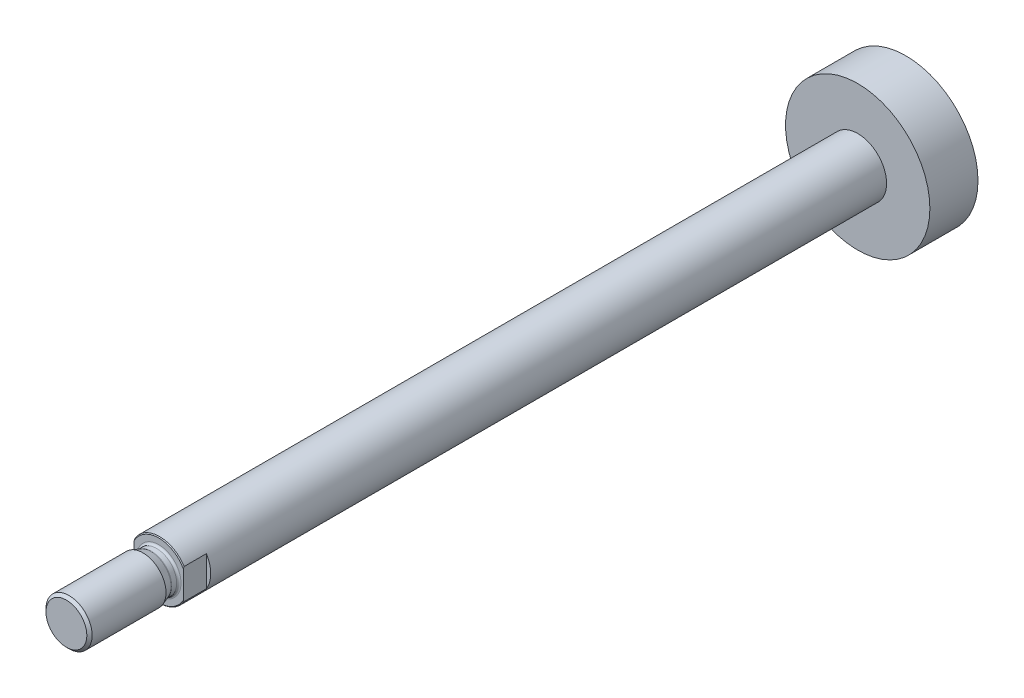
ISO-10303-21;
HEADER;
FILE_DESCRIPTION(('STEP AP214'),'2;1');
FILE_NAME('part.step','',(''),(''),'','','');
FILE_SCHEMA(('AUTOMOTIVE_DESIGN { 1 0 10303 214 1 1 1 1 }'));
ENDSEC;
DATA;
#1=APPLICATION_CONTEXT('core data for automotive mechanical design processes');
#2=APPLICATION_PROTOCOL_DEFINITION('international standard','automotive_design',2000,#1);
#3=PRODUCT_CONTEXT('',#1,'mechanical');
#4=PRODUCT('Part','Part','',(#3));
#5=PRODUCT_RELATED_PRODUCT_CATEGORY('part','',(#4));
#6=PRODUCT_DEFINITION_FORMATION('','',#4);
#7=PRODUCT_DEFINITION_CONTEXT('part definition',#1,'design');
#8=PRODUCT_DEFINITION('design','',#6,#7);
#9=PRODUCT_DEFINITION_SHAPE('','',#8);
#10=(LENGTH_UNIT() NAMED_UNIT(*) SI_UNIT(.MILLI.,.METRE.));
#11=(NAMED_UNIT(*) PLANE_ANGLE_UNIT() SI_UNIT($,.RADIAN.));
#12=(NAMED_UNIT(*) SI_UNIT($,.STERADIAN.) SOLID_ANGLE_UNIT());
#13=UNCERTAINTY_MEASURE_WITH_UNIT(LENGTH_MEASURE(1.E-05),#10,'distance_accuracy_value','');
#14=(GEOMETRIC_REPRESENTATION_CONTEXT(3) GLOBAL_UNCERTAINTY_ASSIGNED_CONTEXT((#13)) GLOBAL_UNIT_ASSIGNED_CONTEXT((#10,
#11,#12)) REPRESENTATION_CONTEXT('',''));
#15=CARTESIAN_POINT('',(0.,0.,0.));
#16=DIRECTION('',(0.,0.,1.));
#17=DIRECTION('',(1.,0.,0.));
#18=AXIS2_PLACEMENT_3D('',#15,#16,#17);
#19=CARTESIAN_POINT('',(0.,0.,35.8));
#20=DIRECTION('',(0.,0.,-1.));
#21=DIRECTION('',(-1.,0.,0.));
#22=AXIS2_PLACEMENT_3D('',#19,#20,#21);
#23=PLANE('',#22);
#24=CARTESIAN_POINT('',(0.,0.,35.8));
#25=DIRECTION('',(0.,0.,1.));
#26=DIRECTION('',(1.,0.,0.));
#27=AXIS2_PLACEMENT_3D('',#24,#25,#26);
#28=CIRCLE('',#27,9.7171572875254);
#29=CARTESIAN_POINT('',(8.5,4.70883698491549,35.8));
#30=VERTEX_POINT('',#29);
#31=CARTESIAN_POINT('',(-8.5,4.70883698491549,35.8));
#32=VERTEX_POINT('',#31);
#33=EDGE_CURVE('E92',#30,#32,#28,.T.);
#34=ORIENTED_EDGE('',*,*,#33,.T.);
#35=DIRECTION('',(0.,-1.,0.));
#36=VECTOR('',#35,1.);
#37=CARTESIAN_POINT('',(-8.5,0.,35.8));
#38=LINE('',#37,#36);
#39=CARTESIAN_POINT('',(-8.5,-4.70883698491549,35.8));
#40=VERTEX_POINT('',#39);
#41=EDGE_CURVE('E134',#32,#40,#38,.T.);
#42=ORIENTED_EDGE('',*,*,#41,.T.);
#43=CARTESIAN_POINT('',(8.5,-4.70883698491549,35.8));
#44=VERTEX_POINT('',#43);
#45=EDGE_CURVE('E122',#40,#44,#28,.T.);
#46=ORIENTED_EDGE('',*,*,#45,.T.);
#47=DIRECTION('',(0.,1.,0.));
#48=VECTOR('',#47,1.);
#49=CARTESIAN_POINT('',(8.5,0.,35.8));
#50=LINE('',#49,#48);
#51=EDGE_CURVE('E136',#44,#30,#50,.T.);
#52=ORIENTED_EDGE('',*,*,#51,.T.);
#53=EDGE_LOOP('',(#34,#42,#46,#52));
#54=FACE_BOUND('',#53,.T.);
#55=CARTESIAN_POINT('',(0.,0.,35.8));
#56=DIRECTION('',(0.,0.,1.));
#57=DIRECTION('',(1.,0.,0.));
#58=AXIS2_PLACEMENT_3D('',#55,#56,#57);
#59=CIRCLE('',#58,7.69999999999987);
#60=CARTESIAN_POINT('',(7.69999999999987,0.,35.8));
#61=VERTEX_POINT('',#60);
#62=EDGE_CURVE('E11',#61,#61,#59,.T.);
#63=ORIENTED_EDGE('',*,*,#62,.F.);
#64=EDGE_LOOP('',(#63));
#65=FACE_BOUND('',#64,.T.);
#66=ADVANCED_FACE('F36',(#54,#65),#23,.F.);
#67=CARTESIAN_POINT('',(0.,0.,35.517157287525));
#68=DIRECTION('',(0.,0.,-1.));
#69=DIRECTION('',(-1.,0.,0.));
#70=AXIS2_PLACEMENT_3D('',#67,#68,#69);
#71=CONICAL_SURFACE('',#70,10.,0.785398163396691);
#72=CARTESIAN_POINT('',(0.,0.,35.517157287525));
#73=DIRECTION('',(0.,0.,1.));
#74=DIRECTION('',(1.,0.,0.));
#75=AXIS2_PLACEMENT_3D('',#72,#73,#74);
#76=CIRCLE('',#75,10.);
#77=CARTESIAN_POINT('',(8.5,5.26782687642637,35.5171572875251));
#78=VERTEX_POINT('',#77);
#79=CARTESIAN_POINT('',(-8.5,5.26782687642637,35.517157287525));
#80=VERTEX_POINT('',#79);
#81=EDGE_CURVE('E106',#78,#80,#76,.T.);
#82=ORIENTED_EDGE('',*,*,#81,.T.);
#83=CARTESIAN_POINT('',(-8.5,20.2931416818416,23.515757347519));
#84=CARTESIAN_POINT('',(-8.5,19.9909532321803,23.7944751985551));
#85=CARTESIAN_POINT('',(-8.5,19.6883087592417,24.0726995764812));
#86=CARTESIAN_POINT('',(-8.5,19.0819693919784,24.6280057982693));
#87=CARTESIAN_POINT('',(-8.5,18.7782744897051,24.9050876334508));
#88=CARTESIAN_POINT('',(-8.5,18.1696326441618,25.4580105647201));
#89=CARTESIAN_POINT('',(-8.5,17.8646854369067,25.7338513704877));
#90=CARTESIAN_POINT('',(-8.5,17.2534360991876,26.2840248711401));
#91=CARTESIAN_POINT('',(-8.5,16.9471339714406,26.5583575690464));
#92=CARTESIAN_POINT('',(-8.5,16.0222310947183,27.3820416740623));
#93=CARTESIAN_POINT('',(-8.5,15.4012748222073,27.9287620268449));
#94=CARTESIAN_POINT('',(-8.5,14.4635790899886,28.74154864027));
#95=CARTESIAN_POINT('',(-8.5,14.1499869172968,29.0112478932058));
#96=CARTESIAN_POINT('',(-8.5,13.5203299168489,29.5477463030762));
#97=CARTESIAN_POINT('',(-8.5,13.2042651003592,29.8145454732116));
#98=CARTESIAN_POINT('',(-8.5,12.6297734485832,30.2941094729625));
#99=CARTESIAN_POINT('',(-8.5,12.3718491936013,30.5074761206756));
#100=CARTESIAN_POINT('',(-8.5,11.8538066740542,30.9315279775626));
#101=CARTESIAN_POINT('',(-8.5,11.5936884275094,31.1422132087248));
#102=CARTESIAN_POINT('',(-8.5,11.0708475228826,31.5604725773234));
#103=CARTESIAN_POINT('',(-8.5,10.8081242003528,31.7680458852596));
#104=CARTESIAN_POINT('',(-8.5,10.2797334506635,32.1794132002748));
#105=CARTESIAN_POINT('',(-8.5,10.0140660451902,32.3832072351625));
#106=CARTESIAN_POINT('',(-8.5,9.47958475304175,32.7860262182227));
#107=CARTESIAN_POINT('',(-8.5,9.21077459368739,32.9850561016847));
#108=CARTESIAN_POINT('',(-8.5,8.66912744527994,33.3775966541477));
#109=CARTESIAN_POINT('',(-8.5,8.39629029886652,33.571107106598));
#110=CARTESIAN_POINT('',(-8.5,7.84601626840244,33.9512419480696));
#111=CARTESIAN_POINT('',(-8.5,7.56858139513561,34.1378692379152));
#112=CARTESIAN_POINT('',(-8.5,7.00820580406304,34.502635365443));
#113=CARTESIAN_POINT('',(-8.5,6.72526571129317,34.6807751589254));
#114=CARTESIAN_POINT('',(-8.5,6.15594369523123,35.0245556092051));
#115=CARTESIAN_POINT('',(-8.5,5.86963011330106,35.1903088027731));
#116=CARTESIAN_POINT('',(-8.5,5.28964170919638,35.5085847634917));
#117=CARTESIAN_POINT('',(-8.5,4.99596607971949,35.6611060714166));
#118=CARTESIAN_POINT('',(-8.5,4.40060972911302,35.9491091194761));
#119=CARTESIAN_POINT('',(-8.5,4.09893609409028,36.0846053703251));
#120=CARTESIAN_POINT('',(-8.5,3.48675946894392,36.3340497452567));
#121=CARTESIAN_POINT('',(-8.5,3.17625906988225,36.4480041192474));
#122=CARTESIAN_POINT('',(-8.5,2.61483993494734,36.6271172168641));
#123=CARTESIAN_POINT('',(-8.5,2.36559695435918,36.6974987360867));
#124=CARTESIAN_POINT('',(-8.5,1.86241147062091,36.8189376790284));
#125=CARTESIAN_POINT('',(-8.5,1.6084695849072,36.8699976229545));
#126=CARTESIAN_POINT('',(-8.5,1.09789808538894,36.9502405878037));
#127=CARTESIAN_POINT('',(-8.5,0.841279054155823,36.9794899738952));
#128=CARTESIAN_POINT('',(-8.5,0.326434251536127,37.0147672549925));
#129=CARTESIAN_POINT('',(-8.5,0.0682085522670807,37.020796184856));
#130=CARTESIAN_POINT('',(-8.5,-0.448145416817141,37.0092732790624));
#131=CARTESIAN_POINT('',(-8.5,-0.70627278006083,36.9916814678558));
#132=CARTESIAN_POINT('',(-8.5,-1.21995794283151,36.9338527652414));
#133=CARTESIAN_POINT('',(-8.5,-1.47551552737243,36.8936139949846));
#134=CARTESIAN_POINT('',(-8.5,-1.98325104270775,36.7924134805506));
#135=CARTESIAN_POINT('',(-8.5,-2.23541619909954,36.7313885363901));
#136=CARTESIAN_POINT('',(-8.5,-2.73462740984176,36.5913102607837));
#137=CARTESIAN_POINT('',(-8.5,-2.98167333960796,36.5122564911396));
#138=CARTESIAN_POINT('',(-8.5,-3.50843039200603,36.3253505755932));
#139=CARTESIAN_POINT('',(-8.5,-3.78722327825433,36.2149295591878));
#140=CARTESIAN_POINT('',(-8.5,-4.33773443529511,35.9775449304111));
#141=CARTESIAN_POINT('',(-8.5,-4.60944947813502,35.8505739233492));
#142=CARTESIAN_POINT('',(-8.5,-5.14670936977486,35.5831632290476));
#143=CARTESIAN_POINT('',(-8.5,-5.41224263972147,35.4427004539824));
#144=CARTESIAN_POINT('',(-8.5,-5.93732373883292,35.1511479577269));
#145=CARTESIAN_POINT('',(-8.5,-6.19687237682658,35.0000596838946));
#146=CARTESIAN_POINT('',(-8.5,-6.71387938945575,34.6874165964157));
#147=CARTESIAN_POINT('',(-8.5,-6.9712740553713,34.5257569209273));
#148=CARTESIAN_POINT('',(-8.5,-7.48143909139906,34.1953123208736));
#149=CARTESIAN_POINT('',(-8.5,-7.73420934795461,34.0265272216725));
#150=CARTESIAN_POINT('',(-8.5,-8.23548894286009,33.6833095797514));
#151=CARTESIAN_POINT('',(-8.5,-8.48400243238768,33.5088830820427));
#152=CARTESIAN_POINT('',(-8.5,-8.97759015317956,33.1552198479584));
#153=CARTESIAN_POINT('',(-8.5,-9.22266424062085,32.9759829113355));
#154=CARTESIAN_POINT('',(-8.5,-9.71078642617179,32.6127907239848));
#155=CARTESIAN_POINT('',(-8.5,-9.95382274810876,32.4288196744083));
#156=CARTESIAN_POINT('',(-8.5,-10.4372856320079,32.0574761238731));
#157=CARTESIAN_POINT('',(-8.5,-10.6777121405417,31.8701035534871));
#158=CARTESIAN_POINT('',(-8.5,-11.3956270119003,31.3036586987131));
#159=CARTESIAN_POINT('',(-8.5,-11.8697201958523,30.9202821895882));
#160=CARTESIAN_POINT('',(-8.5,-12.8113091720513,30.1448280086812));
#161=CARTESIAN_POINT('',(-8.5,-13.2787996354339,29.7527438999861));
#162=CARTESIAN_POINT('',(-8.5,-14.208345382446,28.9621780256694));
#163=CARTESIAN_POINT('',(-8.5,-14.6704005643798,28.5636961406722));
#164=CARTESIAN_POINT('',(-8.5,-15.5669685578569,27.7820273007368));
#165=CARTESIAN_POINT('',(-8.5,-16.0016941293602,27.3990838847476));
#166=CARTESIAN_POINT('',(-8.5,-16.8679762920872,26.6296198506884));
#167=CARTESIAN_POINT('',(-8.5,-17.2995328365627,26.2430991800375));
#168=CARTESIAN_POINT('',(-8.5,-18.1593436587422,25.4677882494838));
#169=CARTESIAN_POINT('',(-8.5,-18.5876021265748,25.0790026310557));
#170=CARTESIAN_POINT('',(-8.5,-19.441916182453,24.2990487562219));
#171=CARTESIAN_POINT('',(-8.5,-19.8679718499203,23.9078805868422));
#172=CARTESIAN_POINT('',(-8.5,-20.2931416818416,23.515757347519));
#173=B_SPLINE_CURVE_WITH_KNOTS('',3,(#83,#84,#85,#86,#87,#88,#89,#90,#91,#92,#93,#94,#95,#96,
#97,#98,#99,#100,#101,#102,#103,#104,#105,#106,#107,#108,#109,#110,#111,#112,#113,#114,#115,
#116,#117,#118,#119,#120,#121,#122,#123,#124,#125,#126,#127,#128,#129,#130,#131,#132,#133,#134,
#135,#136,#137,#138,#139,#140,#141,#142,#143,#144,#145,#146,#147,#148,#149,#150,#151,#152,#153,
#154,#155,#156,#157,#158,#159,#160,#161,#162,#163,#164,#165,#166,#167,#168,#169,#170,#171,#172),
.UNSPECIFIED.,.F.,.F.,(4,2,2,2,2,2,2,2,2,2,2,2,2,2,2,2,2,2,2,2,2,2,2,2,2,2,2,2,2,2,2,2,2,2,2,2,
2,2,2,2,2,2,2,2,4),(0.,1.23329407253431,2.46659749779123,3.70017581984456,4.93375166947274,
7.41567899242145,8.65651239378874,9.89734014466902,10.9015425300163,11.90573667531,
12.910193898079,13.914643726906,14.9180035554579,15.9214026960911,16.9243740186213,
17.92723212555,18.9194528406625,19.9117828401356,20.9032612403186,21.8944515415967,
22.6707670326634,23.4469812301937,24.2208238157496,24.9946319133469,25.769751249464,
26.5449349009176,27.3224968404861,28.1000776810467,28.998994332504,29.8983140140303,
30.7992010482168,31.6999656043992,32.6116741068211,33.5234049671227,34.4341892823232,
35.3450115703321,36.2594200447373,37.1738472038776,39.0028160017191,40.8331850617676,
42.6635883142832,44.4015778846047,46.1395930417818,47.8748171514264,49.6099782553012),.UNSPECIFIED.);
#174=EDGE_CURVE('E119',#80,#32,#173,.T.);
#175=ORIENTED_EDGE('',*,*,#174,.T.);
#176=ORIENTED_EDGE('',*,*,#33,.F.);
#177=CARTESIAN_POINT('',(8.5,-20.2931416818416,23.515757347519));
#178=CARTESIAN_POINT('',(8.5,-19.9909532321803,23.7944751985551));
#179=CARTESIAN_POINT('',(8.5,-19.6883087592417,24.0726995764812));
#180=CARTESIAN_POINT('',(8.5,-19.0819693919784,24.6280057982693));
#181=CARTESIAN_POINT('',(8.5,-18.7782744897051,24.9050876334508));
#182=CARTESIAN_POINT('',(8.5,-18.1696326441618,25.4580105647201));
#183=CARTESIAN_POINT('',(8.5,-17.8646854369067,25.7338513704877));
#184=CARTESIAN_POINT('',(8.5,-17.2534360991876,26.2840248711401));
#185=CARTESIAN_POINT('',(8.5,-16.9471339714406,26.5583575690464));
#186=CARTESIAN_POINT('',(8.5,-16.0222310947183,27.3820416740623));
#187=CARTESIAN_POINT('',(8.5,-15.4012748222073,27.9287620268449));
#188=CARTESIAN_POINT('',(8.5,-14.4635790899886,28.74154864027));
#189=CARTESIAN_POINT('',(8.5,-14.1499869172968,29.0112478932058));
#190=CARTESIAN_POINT('',(8.5,-13.5203299168489,29.5477463030762));
#191=CARTESIAN_POINT('',(8.5,-13.2042651003592,29.8145454732116));
#192=CARTESIAN_POINT('',(8.5,-12.6297734485832,30.2941094729625));
#193=CARTESIAN_POINT('',(8.5,-12.3718491936013,30.5074761206756));
#194=CARTESIAN_POINT('',(8.5,-11.8538066740542,30.9315279775626));
#195=CARTESIAN_POINT('',(8.5,-11.5936884275094,31.1422132087248));
#196=CARTESIAN_POINT('',(8.5,-11.0708475228826,31.5604725773234));
#197=CARTESIAN_POINT('',(8.5,-10.8081242003528,31.7680458852596));
#198=CARTESIAN_POINT('',(8.5,-10.2797334506635,32.1794132002748));
#199=CARTESIAN_POINT('',(8.5,-10.0140660451902,32.3832072351625));
#200=CARTESIAN_POINT('',(8.5,-9.47958475304175,32.7860262182227));
#201=CARTESIAN_POINT('',(8.5,-9.21077459368739,32.9850561016847));
#202=CARTESIAN_POINT('',(8.5,-8.66912744527994,33.3775966541477));
#203=CARTESIAN_POINT('',(8.5,-8.39629029886652,33.571107106598));
#204=CARTESIAN_POINT('',(8.5,-7.84601626840244,33.9512419480696));
#205=CARTESIAN_POINT('',(8.5,-7.56858139513561,34.1378692379152));
#206=CARTESIAN_POINT('',(8.5,-7.00820580406304,34.502635365443));
#207=CARTESIAN_POINT('',(8.5,-6.72526571129317,34.6807751589254));
#208=CARTESIAN_POINT('',(8.5,-6.15594369523123,35.0245556092051));
#209=CARTESIAN_POINT('',(8.5,-5.86963011330106,35.1903088027731));
#210=CARTESIAN_POINT('',(8.5,-5.28964170919638,35.5085847634917));
#211=CARTESIAN_POINT('',(8.5,-4.99596607971949,35.6611060714166));
#212=CARTESIAN_POINT('',(8.5,-4.40060972911302,35.9491091194761));
#213=CARTESIAN_POINT('',(8.5,-4.09893609409028,36.0846053703251));
#214=CARTESIAN_POINT('',(8.5,-3.48675946894392,36.3340497452567));
#215=CARTESIAN_POINT('',(8.5,-3.17625906988225,36.4480041192474));
#216=CARTESIAN_POINT('',(8.5,-2.61483993494734,36.6271172168641));
#217=CARTESIAN_POINT('',(8.5,-2.36559695435918,36.6974987360867));
#218=CARTESIAN_POINT('',(8.5,-1.86241147062091,36.8189376790284));
#219=CARTESIAN_POINT('',(8.5,-1.6084695849072,36.8699976229545));
#220=CARTESIAN_POINT('',(8.5,-1.09789808538894,36.9502405878037));
#221=CARTESIAN_POINT('',(8.5,-0.841279054155823,36.9794899738952));
#222=CARTESIAN_POINT('',(8.5,-0.326434251536127,37.0147672549925));
#223=CARTESIAN_POINT('',(8.5,-0.0682085522670807,37.020796184856));
#224=CARTESIAN_POINT('',(8.5,0.448145416817141,37.0092732790624));
#225=CARTESIAN_POINT('',(8.5,0.70627278006083,36.9916814678558));
#226=CARTESIAN_POINT('',(8.5,1.21995794283151,36.9338527652414));
#227=CARTESIAN_POINT('',(8.5,1.47551552737243,36.8936139949846));
#228=CARTESIAN_POINT('',(8.5,1.98325104270775,36.7924134805506));
#229=CARTESIAN_POINT('',(8.5,2.23541619909954,36.7313885363901));
#230=CARTESIAN_POINT('',(8.5,2.73462740984176,36.5913102607837));
#231=CARTESIAN_POINT('',(8.5,2.98167333960796,36.5122564911396));
#232=CARTESIAN_POINT('',(8.5,3.50843039200603,36.3253505755932));
#233=CARTESIAN_POINT('',(8.5,3.78722327825433,36.2149295591878));
#234=CARTESIAN_POINT('',(8.5,4.33773443529511,35.9775449304111));
#235=CARTESIAN_POINT('',(8.5,4.60944947813502,35.8505739233492));
#236=CARTESIAN_POINT('',(8.5,5.14670936977486,35.5831632290476));
#237=CARTESIAN_POINT('',(8.5,5.41224263972147,35.4427004539824));
#238=CARTESIAN_POINT('',(8.5,5.93732373883292,35.1511479577269));
#239=CARTESIAN_POINT('',(8.5,6.19687237682658,35.0000596838946));
#240=CARTESIAN_POINT('',(8.5,6.71387938945575,34.6874165964157));
#241=CARTESIAN_POINT('',(8.5,6.9712740553713,34.5257569209273));
#242=CARTESIAN_POINT('',(8.5,7.48143909139906,34.1953123208736));
#243=CARTESIAN_POINT('',(8.5,7.73420934795461,34.0265272216725));
#244=CARTESIAN_POINT('',(8.5,8.23548894286009,33.6833095797514));
#245=CARTESIAN_POINT('',(8.5,8.48400243238768,33.5088830820427));
#246=CARTESIAN_POINT('',(8.5,8.97759015317956,33.1552198479584));
#247=CARTESIAN_POINT('',(8.5,9.22266424062085,32.9759829113355));
#248=CARTESIAN_POINT('',(8.5,9.71078642617179,32.6127907239848));
#249=CARTESIAN_POINT('',(8.5,9.95382274810876,32.4288196744083));
#250=CARTESIAN_POINT('',(8.5,10.4372856320079,32.0574761238731));
#251=CARTESIAN_POINT('',(8.5,10.6777121405417,31.8701035534871));
#252=CARTESIAN_POINT('',(8.5,11.3956270119003,31.3036586987131));
#253=CARTESIAN_POINT('',(8.5,11.8697201958523,30.9202821895882));
#254=CARTESIAN_POINT('',(8.5,12.8113091720513,30.1448280086812));
#255=CARTESIAN_POINT('',(8.5,13.2787996354339,29.7527438999861));
#256=CARTESIAN_POINT('',(8.5,14.208345382446,28.9621780256694));
#257=CARTESIAN_POINT('',(8.5,14.6704005643798,28.5636961406722));
#258=CARTESIAN_POINT('',(8.5,15.5669685578569,27.7820273007368));
#259=CARTESIAN_POINT('',(8.5,16.0016941293602,27.3990838847476));
#260=CARTESIAN_POINT('',(8.5,16.8679762920872,26.6296198506884));
#261=CARTESIAN_POINT('',(8.5,17.2995328365627,26.2430991800375));
#262=CARTESIAN_POINT('',(8.5,18.1593436587422,25.4677882494838));
#263=CARTESIAN_POINT('',(8.5,18.5876021265748,25.0790026310557));
#264=CARTESIAN_POINT('',(8.5,19.441916182453,24.2990487562219));
#265=CARTESIAN_POINT('',(8.5,19.8679718499203,23.9078805868422));
#266=CARTESIAN_POINT('',(8.5,20.2931416818416,23.515757347519));
#267=B_SPLINE_CURVE_WITH_KNOTS('',3,(#177,#178,#179,#180,#181,#182,#183,#184,#185,#186,#187,
#188,#189,#190,#191,#192,#193,#194,#195,#196,#197,#198,#199,#200,#201,#202,#203,#204,#205,#206,
#207,#208,#209,#210,#211,#212,#213,#214,#215,#216,#217,#218,#219,#220,#221,#222,#223,#224,#225,
#226,#227,#228,#229,#230,#231,#232,#233,#234,#235,#236,#237,#238,#239,#240,#241,#242,#243,#244,
#245,#246,#247,#248,#249,#250,#251,#252,#253,#254,#255,#256,#257,#258,#259,#260,#261,#262,#263,
#264,#265,#266),.UNSPECIFIED.,.F.,.F.,(4,2,2,2,2,2,2,2,2,2,2,2,2,2,2,2,2,2,2,2,2,2,2,2,2,2,2,2,
2,2,2,2,2,2,2,2,2,2,2,2,2,2,2,2,4),(0.,1.23329407253431,2.46659749779123,3.70017581984456,
4.93375166947274,7.41567899242145,8.65651239378874,9.89734014466902,10.9015425300163,
11.90573667531,12.910193898079,13.914643726906,14.9180035554579,15.9214026960911,
16.9243740186213,17.92723212555,18.9194528406625,19.9117828401356,20.9032612403186,
21.8944515415967,22.6707670326634,23.4469812301937,24.2208238157496,24.9946319133469,
25.769751249464,26.5449349009176,27.3224968404861,28.1000776810467,28.998994332504,
29.8983140140303,30.7992010482168,31.6999656043992,32.6116741068211,33.5234049671227,
34.4341892823232,35.3450115703321,36.2594200447373,37.1738472038776,39.0028160017191,
40.8331850617676,42.6635883142832,44.4015778846047,46.1395930417818,47.8748171514264,
49.6099782553012),.UNSPECIFIED.);
#268=EDGE_CURVE('E121',#30,#78,#267,.T.);
#269=ORIENTED_EDGE('',*,*,#268,.T.);
#270=EDGE_LOOP('',(#82,#175,#176,#269));
#271=FACE_BOUND('',#270,.T.);
#272=ADVANCED_FACE('F117',(#271),#71,.T.);
#273=ORIENTED_EDGE('',*,*,#45,.F.);
#274=CARTESIAN_POINT('',(-8.5,-5.26782687642637,35.5171572875251));
#275=VERTEX_POINT('',#274);
#276=EDGE_CURVE('E140',#40,#275,#173,.T.);
#277=ORIENTED_EDGE('',*,*,#276,.T.);
#278=CARTESIAN_POINT('',(8.5,-5.26782687642637,35.517157287525));
#279=VERTEX_POINT('',#278);
#280=EDGE_CURVE('E123',#275,#279,#76,.T.);
#281=ORIENTED_EDGE('',*,*,#280,.T.);
#282=EDGE_CURVE('E138',#279,#44,#267,.T.);
#283=ORIENTED_EDGE('',*,*,#282,.T.);
#284=EDGE_LOOP('',(#273,#277,#281,#283));
#285=FACE_BOUND('',#284,.T.);
#286=ADVANCED_FACE('F156',(#285),#71,.T.);
#287=CARTESIAN_POINT('',(0.,0.,-223.));
#288=DIRECTION('',(0.,0.,1.));
#289=DIRECTION('',(1.,0.,0.));
#290=AXIS2_PLACEMENT_3D('',#287,#288,#289);
#291=CYLINDRICAL_SURFACE('',#290,10.);
#292=CARTESIAN_POINT('',(0.,0.,27.8));
#293=DIRECTION('',(0.,0.,-1.));
#294=DIRECTION('',(-1.,0.,0.));
#295=AXIS2_PLACEMENT_3D('',#292,#293,#294);
#296=CIRCLE('',#295,10.);
#297=CARTESIAN_POINT('',(-8.5,-5.26782687642637,27.8));
#298=VERTEX_POINT('',#297);
#299=CARTESIAN_POINT('',(-8.5,5.26782687642637,27.8));
#300=VERTEX_POINT('',#299);
#301=EDGE_CURVE('E114',#298,#300,#296,.T.);
#302=ORIENTED_EDGE('',*,*,#301,.T.);
#303=DIRECTION('',(0.,0.,1.));
#304=VECTOR('',#303,1.);
#305=CARTESIAN_POINT('',(-8.5,5.26782687642637,-223.));
#306=LINE('',#305,#304);
#307=EDGE_CURVE('E43',#300,#80,#306,.T.);
#308=ORIENTED_EDGE('',*,*,#307,.T.);
#309=ORIENTED_EDGE('',*,*,#81,.F.);
#310=DIRECTION('',(0.,0.,1.));
#311=VECTOR('',#310,1.);
#312=CARTESIAN_POINT('',(8.5,5.26782687642637,-223.));
#313=LINE('',#312,#311);
#314=CARTESIAN_POINT('',(8.5,5.26782687642637,27.8));
#315=VERTEX_POINT('',#314);
#316=EDGE_CURVE('E91',#78,#315,#313,.F.);
#317=ORIENTED_EDGE('',*,*,#316,.T.);
#318=CARTESIAN_POINT('',(0.,0.,27.8));
#319=DIRECTION('',(0.,0.,-1.));
#320=DIRECTION('',(-1.,0.,0.));
#321=AXIS2_PLACEMENT_3D('',#318,#319,#320);
#322=CIRCLE('',#321,10.);
#323=CARTESIAN_POINT('',(8.5,-5.26782687642637,27.8));
#324=VERTEX_POINT('',#323);
#325=EDGE_CURVE('E86',#315,#324,#322,.T.);
#326=ORIENTED_EDGE('',*,*,#325,.T.);
#327=DIRECTION('',(0.,0.,1.));
#328=VECTOR('',#327,1.);
#329=CARTESIAN_POINT('',(8.5,-5.26782687642637,-223.));
#330=LINE('',#329,#328);
#331=EDGE_CURVE('E97',#324,#279,#330,.T.);
#332=ORIENTED_EDGE('',*,*,#331,.T.);
#333=ORIENTED_EDGE('',*,*,#280,.F.);
#334=DIRECTION('',(0.,0.,1.));
#335=VECTOR('',#334,1.);
#336=CARTESIAN_POINT('',(-8.5,-5.26782687642637,-223.));
#337=LINE('',#336,#335);
#338=EDGE_CURVE('E108',#275,#298,#337,.F.);
#339=ORIENTED_EDGE('',*,*,#338,.T.);
#340=EDGE_LOOP('',(#302,#308,#309,#317,#326,#332,#333,#339));
#341=FACE_BOUND('',#340,.T.);
#342=CARTESIAN_POINT('',(0.,0.,-206.33333333333));
#343=DIRECTION('',(0.,0.,1.));
#344=DIRECTION('',(1.,0.,0.));
#345=AXIS2_PLACEMENT_3D('',#342,#343,#344);
#346=CIRCLE('',#345,10.);
#347=CARTESIAN_POINT('',(10.,0.,-206.33333333333));
#348=VERTEX_POINT('',#347);
#349=EDGE_CURVE('E127',#348,#348,#346,.T.);
#350=ORIENTED_EDGE('',*,*,#349,.T.);
#351=EDGE_LOOP('',(#350));
#352=FACE_BOUND('',#351,.T.);
#353=ADVANCED_FACE('F102',(#341,#352),#291,.T.);
#354=CARTESIAN_POINT('',(0.,10.,-206.33333333333));
#355=DIRECTION('',(0.,0.,-1.));
#356=DIRECTION('',(-1.,0.,0.));
#357=AXIS2_PLACEMENT_3D('',#354,#355,#356);
#358=PLANE('',#357);
#359=ORIENTED_EDGE('',*,*,#349,.F.);
#360=EDGE_LOOP('',(#359));
#361=FACE_BOUND('',#360,.T.);
#362=CARTESIAN_POINT('',(0.,0.,-206.33333333333));
#363=DIRECTION('',(0.,0.,1.));
#364=DIRECTION('',(1.,0.,0.));
#365=AXIS2_PLACEMENT_3D('',#362,#363,#364);
#366=CIRCLE('',#365,25.);
#367=CARTESIAN_POINT('',(25.,0.,-206.33333333333));
#368=VERTEX_POINT('',#367);
#369=EDGE_CURVE('E382',#368,#368,#366,.T.);
#370=ORIENTED_EDGE('',*,*,#369,.T.);
#371=EDGE_LOOP('',(#370));
#372=FACE_BOUND('',#371,.T.);
#373=ADVANCED_FACE('F178',(#361,#372),#358,.F.);
#374=CARTESIAN_POINT('',(0.,0.,-223.));
#375=DIRECTION('',(0.,0.,1.));
#376=DIRECTION('',(1.,0.,0.));
#377=AXIS2_PLACEMENT_3D('',#374,#375,#376);
#378=CYLINDRICAL_SURFACE('',#377,25.);
#379=ORIENTED_EDGE('',*,*,#369,.F.);
#380=EDGE_LOOP('',(#379));
#381=FACE_BOUND('',#380,.T.);
#382=CARTESIAN_POINT('',(0.,0.,-223.));
#383=DIRECTION('',(0.,0.,1.));
#384=DIRECTION('',(1.,0.,0.));
#385=AXIS2_PLACEMENT_3D('',#382,#383,#384);
#386=CIRCLE('',#385,25.);
#387=CARTESIAN_POINT('',(25.,0.,-223.));
#388=VERTEX_POINT('',#387);
#389=EDGE_CURVE('E380',#388,#388,#386,.T.);
#390=ORIENTED_EDGE('',*,*,#389,.T.);
#391=EDGE_LOOP('',(#390));
#392=FACE_BOUND('',#391,.T.);
#393=ADVANCED_FACE('F174',(#381,#392),#378,.T.);
#394=CARTESIAN_POINT('',(0.,25.,-223.));
#395=DIRECTION('',(0.,0.,1.));
#396=DIRECTION('',(1.,0.,0.));
#397=AXIS2_PLACEMENT_3D('',#394,#395,#396);
#398=PLANE('',#397);
#399=ORIENTED_EDGE('',*,*,#389,.F.);
#400=EDGE_LOOP('',(#399));
#401=FACE_BOUND('',#400,.T.);
#402=ADVANCED_FACE('F171',(#401),#398,.F.);
#403=CARTESIAN_POINT('',(17.,-17.,27.8));
#404=DIRECTION('',(0.,0.,-1.));
#405=DIRECTION('',(-1.,0.,0.));
#406=AXIS2_PLACEMENT_3D('',#403,#404,#405);
#407=PLANE('',#406);
#408=DIRECTION('',(0.,1.,0.));
#409=VECTOR('',#408,1.);
#410=CARTESIAN_POINT('',(8.5,-17.,27.8));
#411=LINE('',#410,#409);
#412=EDGE_CURVE('E57',#324,#315,#411,.T.);
#413=ORIENTED_EDGE('',*,*,#412,.F.);
#414=ORIENTED_EDGE('',*,*,#325,.F.);
#415=EDGE_LOOP('',(#413,#414));
#416=FACE_BOUND('',#415,.T.);
#417=ADVANCED_FACE('F87',(#416),#407,.F.);
#418=CARTESIAN_POINT('',(8.5,-17.,27.8));
#419=DIRECTION('',(-1.,0.,0.));
#420=DIRECTION('',(0.,0.,1.));
#421=AXIS2_PLACEMENT_3D('',#418,#419,#420);
#422=PLANE('',#421);
#423=ORIENTED_EDGE('',*,*,#412,.T.);
#424=ORIENTED_EDGE('',*,*,#316,.F.);
#425=ORIENTED_EDGE('',*,*,#268,.F.);
#426=ORIENTED_EDGE('',*,*,#51,.F.);
#427=ORIENTED_EDGE('',*,*,#282,.F.);
#428=ORIENTED_EDGE('',*,*,#331,.F.);
#429=EDGE_LOOP('',(#423,#424,#425,#426,#427,#428));
#430=FACE_BOUND('',#429,.T.);
#431=ADVANCED_FACE('F95',(#430),#422,.F.);
#432=CARTESIAN_POINT('',(-8.5,-17.,27.8));
#433=DIRECTION('',(0.,0.,-1.));
#434=DIRECTION('',(-1.,0.,0.));
#435=AXIS2_PLACEMENT_3D('',#432,#433,#434);
#436=PLANE('',#435);
#437=DIRECTION('',(0.,1.,0.));
#438=VECTOR('',#437,1.);
#439=CARTESIAN_POINT('',(-8.5,-17.,27.8));
#440=LINE('',#439,#438);
#441=EDGE_CURVE('E50',#298,#300,#440,.T.);
#442=ORIENTED_EDGE('',*,*,#441,.T.);
#443=ORIENTED_EDGE('',*,*,#301,.F.);
#444=EDGE_LOOP('',(#442,#443));
#445=FACE_BOUND('',#444,.T.);
#446=ADVANCED_FACE('F164',(#445),#436,.F.);
#447=CARTESIAN_POINT('',(-8.5,-17.,43.8));
#448=DIRECTION('',(1.,0.,0.));
#449=DIRECTION('',(0.,0.,-1.));
#450=AXIS2_PLACEMENT_3D('',#447,#448,#449);
#451=PLANE('',#450);
#452=ORIENTED_EDGE('',*,*,#441,.F.);
#453=ORIENTED_EDGE('',*,*,#338,.F.);
#454=ORIENTED_EDGE('',*,*,#276,.F.);
#455=ORIENTED_EDGE('',*,*,#41,.F.);
#456=ORIENTED_EDGE('',*,*,#174,.F.);
#457=ORIENTED_EDGE('',*,*,#307,.F.);
#458=EDGE_LOOP('',(#452,#453,#454,#455,#456,#457));
#459=FACE_BOUND('',#458,.T.);
#460=ADVANCED_FACE('F159',(#459),#451,.F.);
#461=CARTESIAN_POINT('',(0.,0.,36.5499999999999));
#462=DIRECTION('',(0.,0.,1.));
#463=DIRECTION('',(1.,0.,0.));
#464=AXIS2_PLACEMENT_3D('',#461,#462,#463);
#465=TOROIDAL_SURFACE('',#464,7.69999999999987,0.749999999999868);
#466=CARTESIAN_POINT('',(0.,0.,36.55));
#467=DIRECTION('',(0.,0.,1.));
#468=DIRECTION('',(1.,0.,0.));
#469=AXIS2_PLACEMENT_3D('',#466,#467,#468);
#470=CIRCLE('',#469,6.95);
#471=CARTESIAN_POINT('',(6.95,0.,36.55));
#472=VERTEX_POINT('',#471);
#473=EDGE_CURVE('E98',#472,#472,#470,.T.);
#474=ORIENTED_EDGE('',*,*,#473,.F.);
#475=EDGE_LOOP('',(#474));
#476=FACE_BOUND('',#475,.T.);
#477=ORIENTED_EDGE('',*,*,#62,.T.);
#478=EDGE_LOOP('',(#477));
#479=FACE_BOUND('',#478,.T.);
#480=ADVANCED_FACE('F163',(#476,#479),#465,.F.);
#481=CARTESIAN_POINT('',(0.,0.,35.05));
#482=DIRECTION('',(0.,0.,1.));
#483=DIRECTION('',(1.,0.,0.));
#484=AXIS2_PLACEMENT_3D('',#481,#482,#483);
#485=CYLINDRICAL_SURFACE('',#484,6.95);
#486=CARTESIAN_POINT('',(0.,0.,38.267754764469));
#487=DIRECTION('',(0.,0.,1.));
#488=DIRECTION('',(1.,0.,0.));
#489=AXIS2_PLACEMENT_3D('',#486,#487,#488);
#490=CIRCLE('',#489,6.95);
#491=CARTESIAN_POINT('',(6.95,0.,38.267754764469));
#492=VERTEX_POINT('',#491);
#493=EDGE_CURVE('E374',#492,#492,#490,.T.);
#494=ORIENTED_EDGE('',*,*,#493,.F.);
#495=EDGE_LOOP('',(#494));
#496=FACE_BOUND('',#495,.T.);
#497=ORIENTED_EDGE('',*,*,#473,.T.);
#498=EDGE_LOOP('',(#497));
#499=FACE_BOUND('',#498,.T.);
#500=ADVANCED_FACE('F222',(#496,#499),#485,.T.);
#501=CARTESIAN_POINT('',(0.,0.,38.2677547644694));
#502=DIRECTION('',(0.,0.,1.));
#503=DIRECTION('',(1.,0.,0.));
#504=AXIS2_PLACEMENT_3D('',#501,#502,#503);
#505=TOROIDAL_SURFACE('',#504,7.69999999999571,0.74999999999571);
#506=CARTESIAN_POINT('',(0.,0.,38.5242698719622));
#507=DIRECTION('',(0.,0.,1.));
#508=DIRECTION('',(1.,0.,0.));
#509=AXIS2_PLACEMENT_3D('',#506,#507,#508);
#510=CIRCLE('',#509,6.99523053441032);
#511=CARTESIAN_POINT('',(6.99523053441032,0.,38.5242698719622));
#512=VERTEX_POINT('',#511);
#513=EDGE_CURVE('E371',#512,#512,#510,.T.);
#514=ORIENTED_EDGE('',*,*,#513,.F.);
#515=EDGE_LOOP('',(#514));
#516=FACE_BOUND('',#515,.T.);
#517=ORIENTED_EDGE('',*,*,#493,.T.);
#518=EDGE_LOOP('',(#517));
#519=FACE_BOUND('',#518,.T.);
#520=ADVANCED_FACE('F212',(#516,#519),#505,.F.);
#521=CARTESIAN_POINT('',(0.,0.,38.5242698719622));
#522=DIRECTION('',(0.,0.,1.));
#523=DIRECTION('',(1.,0.,0.));
#524=AXIS2_PLACEMENT_3D('',#521,#522,#523);
#525=CONICAL_SURFACE('',#524,6.99523053441032,0.349065850398908);
#526=CARTESIAN_POINT('',(0.,0.,41.284851290427));
#527=DIRECTION('',(0.,0.,1.));
#528=DIRECTION('',(1.,0.,0.));
#529=AXIS2_PLACEMENT_3D('',#526,#527,#528);
#530=CIRCLE('',#529,8.);
#531=CARTESIAN_POINT('',(8.,0.,41.284851290427));
#532=VERTEX_POINT('',#531);
#533=EDGE_CURVE('E366',#532,#532,#530,.T.);
#534=ORIENTED_EDGE('',*,*,#533,.F.);
#535=EDGE_LOOP('',(#534));
#536=FACE_BOUND('',#535,.T.);
#537=ORIENTED_EDGE('',*,*,#513,.T.);
#538=EDGE_LOOP('',(#537));
#539=FACE_BOUND('',#538,.T.);
#540=ADVANCED_FACE('F206',(#536,#539),#525,.T.);
#541=CARTESIAN_POINT('',(0.,0.,35.05));
#542=DIRECTION('',(0.,0.,1.));
#543=DIRECTION('',(1.,0.,0.));
#544=AXIS2_PLACEMENT_3D('',#541,#542,#543);
#545=CYLINDRICAL_SURFACE('',#544,8.);
#546=CARTESIAN_POINT('',(0.,0.,66.88));
#547=DIRECTION('',(0.,0.,1.));
#548=DIRECTION('',(1.,0.,0.));
#549=AXIS2_PLACEMENT_3D('',#546,#547,#548);
#550=CIRCLE('',#549,8.);
#551=CARTESIAN_POINT('',(8.,0.,66.88));
#552=VERTEX_POINT('',#551);
#553=EDGE_CURVE('E363',#552,#552,#550,.T.);
#554=ORIENTED_EDGE('',*,*,#553,.F.);
#555=EDGE_LOOP('',(#554));
#556=FACE_BOUND('',#555,.T.);
#557=ORIENTED_EDGE('',*,*,#533,.T.);
#558=EDGE_LOOP('',(#557));
#559=FACE_BOUND('',#558,.T.);
#560=ADVANCED_FACE('F211',(#556,#559),#545,.T.);
#561=CARTESIAN_POINT('',(0.,0.,66.88));
#562=DIRECTION('',(0.,0.,-1.));
#563=DIRECTION('',(-1.,0.,0.));
#564=AXIS2_PLACEMENT_3D('',#561,#562,#563);
#565=CONICAL_SURFACE('',#564,8.,0.785398163397446);
#566=CARTESIAN_POINT('',(0.,0.,67.8));
#567=DIRECTION('',(0.,0.,1.));
#568=DIRECTION('',(1.,0.,0.));
#569=AXIS2_PLACEMENT_3D('',#566,#567,#568);
#570=CIRCLE('',#569,7.08);
#571=CARTESIAN_POINT('',(7.08,0.,67.8));
#572=VERTEX_POINT('',#571);
#573=EDGE_CURVE('E362',#572,#572,#570,.T.);
#574=ORIENTED_EDGE('',*,*,#573,.F.);
#575=EDGE_LOOP('',(#574));
#576=FACE_BOUND('',#575,.T.);
#577=ORIENTED_EDGE('',*,*,#553,.T.);
#578=EDGE_LOOP('',(#577));
#579=FACE_BOUND('',#578,.T.);
#580=ADVANCED_FACE('F234',(#576,#579),#565,.T.);
#581=CARTESIAN_POINT('',(0.,0.,67.8));
#582=DIRECTION('',(0.,0.,-1.));
#583=DIRECTION('',(-1.,0.,0.));
#584=AXIS2_PLACEMENT_3D('',#581,#582,#583);
#585=PLANE('',#584);
#586=ORIENTED_EDGE('',*,*,#573,.T.);
#587=EDGE_LOOP('',(#586));
#588=FACE_BOUND('',#587,.T.);
#589=ADVANCED_FACE('F239',(#588),#585,.F.);
#590=CLOSED_SHELL('',(#66,#272,#286,#353,#373,#393,#402,#417,#431,#446,#460,#480,#500,#520,#540,
#560,#580,#589));
#591=MANIFOLD_SOLID_BREP('B2',#590);
#592=ADVANCED_BREP_SHAPE_REPRESENTATION('',(#18,#591),#14);
#593=SHAPE_DEFINITION_REPRESENTATION(#9,#592);
ENDSEC;
END-ISO-10303-21;
